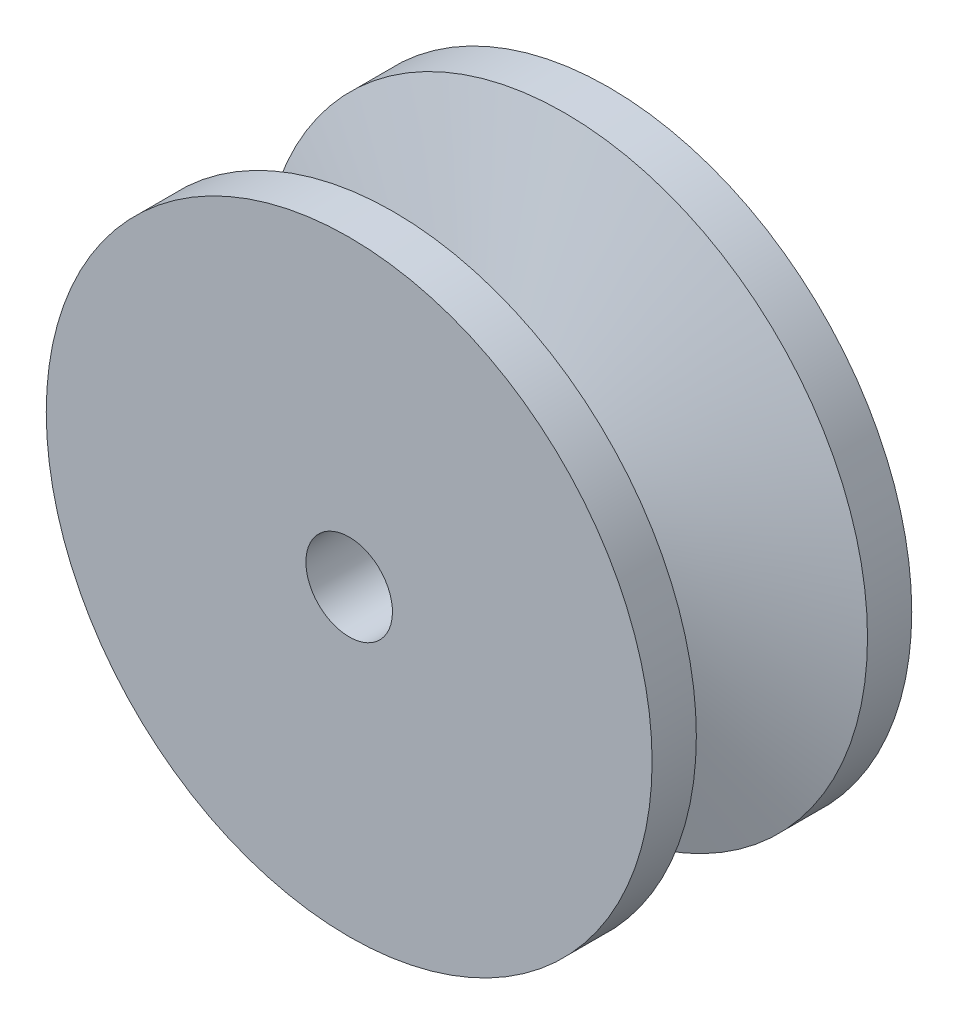
ISO-10303-21;
HEADER;
FILE_DESCRIPTION(('STEP AP214'),'2;1');
FILE_NAME('part.step','',(''),(''),'','','');
FILE_SCHEMA(('AUTOMOTIVE_DESIGN { 1 0 10303 214 1 1 1 1 }'));
ENDSEC;
DATA;
#1=APPLICATION_CONTEXT('core data for automotive mechanical design processes');
#2=APPLICATION_PROTOCOL_DEFINITION('international standard','automotive_design',2000,#1);
#3=PRODUCT_CONTEXT('',#1,'mechanical');
#4=PRODUCT('Part','Part','',(#3));
#5=PRODUCT_RELATED_PRODUCT_CATEGORY('part','',(#4));
#6=PRODUCT_DEFINITION_FORMATION('','',#4);
#7=PRODUCT_DEFINITION_CONTEXT('part definition',#1,'design');
#8=PRODUCT_DEFINITION('design','',#6,#7);
#9=PRODUCT_DEFINITION_SHAPE('','',#8);
#10=(LENGTH_UNIT() NAMED_UNIT(*) SI_UNIT(.MILLI.,.METRE.));
#11=(NAMED_UNIT(*) PLANE_ANGLE_UNIT() SI_UNIT($,.RADIAN.));
#12=(NAMED_UNIT(*) SI_UNIT($,.STERADIAN.) SOLID_ANGLE_UNIT());
#13=UNCERTAINTY_MEASURE_WITH_UNIT(LENGTH_MEASURE(1.E-05),#10,'distance_accuracy_value','');
#14=(GEOMETRIC_REPRESENTATION_CONTEXT(3) GLOBAL_UNCERTAINTY_ASSIGNED_CONTEXT((#13)) GLOBAL_UNIT_ASSIGNED_CONTEXT((#10,
#11,#12)) REPRESENTATION_CONTEXT('',''));
#15=CARTESIAN_POINT('',(0.,0.,0.));
#16=DIRECTION('',(0.,0.,1.));
#17=DIRECTION('',(1.,0.,0.));
#18=AXIS2_PLACEMENT_3D('',#15,#16,#17);
#19=CARTESIAN_POINT('',(0.,0.,9.525));
#20=DIRECTION('',(0.,0.,-1.));
#21=DIRECTION('',(-1.,0.,0.));
#22=AXIS2_PLACEMENT_3D('',#19,#20,#21);
#23=PLANE('',#22);
#24=CARTESIAN_POINT('',(0.,0.,9.525));
#25=DIRECTION('',(0.,0.,-1.));
#26=DIRECTION('',(0.,1.,0.));
#27=AXIS2_PLACEMENT_3D('',#24,#25,#26);
#28=CIRCLE('',#27,3.175);
#29=CARTESIAN_POINT('',(0.,3.175,9.525));
#30=VERTEX_POINT('',#29);
#31=EDGE_CURVE('E67',#30,#30,#28,.T.);
#32=ORIENTED_EDGE('',*,*,#31,.T.);
#33=EDGE_LOOP('',(#32));
#34=FACE_BOUND('',#33,.T.);
#35=CARTESIAN_POINT('',(0.,0.,9.525));
#36=DIRECTION('',(0.,0.,1.));
#37=DIRECTION('',(1.,0.,0.));
#38=AXIS2_PLACEMENT_3D('',#35,#36,#37);
#39=CIRCLE('',#38,22.225);
#40=CARTESIAN_POINT('',(22.225,0.,9.525));
#41=VERTEX_POINT('',#40);
#42=EDGE_CURVE('E12',#41,#41,#39,.T.);
#43=ORIENTED_EDGE('',*,*,#42,.T.);
#44=EDGE_LOOP('',(#43));
#45=FACE_BOUND('',#44,.T.);
#46=ADVANCED_FACE('F42',(#34,#45),#23,.F.);
#47=CARTESIAN_POINT('',(0.,0.,9.525));
#48=DIRECTION('',(0.,0.,1.));
#49=DIRECTION('',(1.,0.,0.));
#50=AXIS2_PLACEMENT_3D('',#47,#48,#49);
#51=CYLINDRICAL_SURFACE('',#50,22.225);
#52=ORIENTED_EDGE('',*,*,#42,.F.);
#53=EDGE_LOOP('',(#52));
#54=FACE_BOUND('',#53,.T.);
#55=CARTESIAN_POINT('',(0.,0.,6.27929491363124));
#56=DIRECTION('',(0.,0.,1.));
#57=DIRECTION('',(1.,0.,0.));
#58=AXIS2_PLACEMENT_3D('',#55,#56,#57);
#59=CIRCLE('',#58,22.225);
#60=CARTESIAN_POINT('',(22.225,0.,6.27929491363124));
#61=VERTEX_POINT('',#60);
#62=EDGE_CURVE('E48',#61,#61,#59,.T.);
#63=ORIENTED_EDGE('',*,*,#62,.T.);
#64=EDGE_LOOP('',(#63));
#65=FACE_BOUND('',#64,.T.);
#66=ADVANCED_FACE('F100',(#54,#65),#51,.T.);
#67=CARTESIAN_POINT('',(0.,0.,2.47417085219678));
#68=DIRECTION('',(0.,0.,1.));
#69=DIRECTION('',(1.,0.,0.));
#70=AXIS2_PLACEMENT_3D('',#67,#68,#69);
#71=CONICAL_SURFACE('',#70,9.779,1.27409035395586);
#72=ORIENTED_EDGE('',*,*,#62,.F.);
#73=EDGE_LOOP('',(#72));
#74=FACE_BOUND('',#73,.T.);
#75=CARTESIAN_POINT('',(0.,0.,2.47417085219678));
#76=DIRECTION('',(0.,0.,1.));
#77=DIRECTION('',(1.,0.,0.));
#78=AXIS2_PLACEMENT_3D('',#75,#76,#77);
#79=CIRCLE('',#78,9.779);
#80=CARTESIAN_POINT('',(9.779,0.,2.47417085219678));
#81=VERTEX_POINT('',#80);
#82=EDGE_CURVE('E52',#81,#81,#79,.T.);
#83=ORIENTED_EDGE('',*,*,#82,.T.);
#84=EDGE_LOOP('',(#83));
#85=FACE_BOUND('',#84,.T.);
#86=ADVANCED_FACE('F104',(#74,#85),#71,.T.);
#87=CARTESIAN_POINT('',(0.,0.,9.525));
#88=DIRECTION('',(0.,0.,1.));
#89=DIRECTION('',(1.,0.,0.));
#90=AXIS2_PLACEMENT_3D('',#87,#88,#89);
#91=CYLINDRICAL_SURFACE('',#90,9.779);
#92=ORIENTED_EDGE('',*,*,#82,.F.);
#93=EDGE_LOOP('',(#92));
#94=FACE_BOUND('',#93,.T.);
#95=CARTESIAN_POINT('',(0.,0.,-2.47417085219678));
#96=DIRECTION('',(0.,0.,1.));
#97=DIRECTION('',(1.,0.,0.));
#98=AXIS2_PLACEMENT_3D('',#95,#96,#97);
#99=CIRCLE('',#98,9.779);
#100=CARTESIAN_POINT('',(9.779,0.,-2.47417085219678));
#101=VERTEX_POINT('',#100);
#102=EDGE_CURVE('E56',#101,#101,#99,.T.);
#103=ORIENTED_EDGE('',*,*,#102,.T.);
#104=EDGE_LOOP('',(#103));
#105=FACE_BOUND('',#104,.T.);
#106=ADVANCED_FACE('F95',(#94,#105),#91,.T.);
#107=CARTESIAN_POINT('',(0.,0.,-6.27929491363124));
#108=DIRECTION('',(0.,0.,-1.));
#109=DIRECTION('',(-1.,0.,0.));
#110=AXIS2_PLACEMENT_3D('',#107,#108,#109);
#111=CONICAL_SURFACE('',#110,22.225,1.27409035395586);
#112=ORIENTED_EDGE('',*,*,#102,.F.);
#113=EDGE_LOOP('',(#112));
#114=FACE_BOUND('',#113,.T.);
#115=CARTESIAN_POINT('',(0.,0.,-6.27929491363124));
#116=DIRECTION('',(0.,0.,1.));
#117=DIRECTION('',(1.,0.,0.));
#118=AXIS2_PLACEMENT_3D('',#115,#116,#117);
#119=CIRCLE('',#118,22.225);
#120=CARTESIAN_POINT('',(22.225,0.,-6.27929491363124));
#121=VERTEX_POINT('',#120);
#122=EDGE_CURVE('E61',#121,#121,#119,.T.);
#123=ORIENTED_EDGE('',*,*,#122,.T.);
#124=EDGE_LOOP('',(#123));
#125=FACE_BOUND('',#124,.T.);
#126=ADVANCED_FACE('F89',(#114,#125),#111,.T.);
#127=CARTESIAN_POINT('',(0.,0.,9.525));
#128=DIRECTION('',(0.,0.,1.));
#129=DIRECTION('',(1.,0.,0.));
#130=AXIS2_PLACEMENT_3D('',#127,#128,#129);
#131=CYLINDRICAL_SURFACE('',#130,22.225);
#132=ORIENTED_EDGE('',*,*,#122,.F.);
#133=EDGE_LOOP('',(#132));
#134=FACE_BOUND('',#133,.T.);
#135=CARTESIAN_POINT('',(0.,0.,-9.525));
#136=DIRECTION('',(0.,0.,1.));
#137=DIRECTION('',(1.,0.,0.));
#138=AXIS2_PLACEMENT_3D('',#135,#136,#137);
#139=CIRCLE('',#138,22.225);
#140=CARTESIAN_POINT('',(22.225,0.,-9.525));
#141=VERTEX_POINT('',#140);
#142=EDGE_CURVE('E64',#141,#141,#139,.T.);
#143=ORIENTED_EDGE('',*,*,#142,.T.);
#144=EDGE_LOOP('',(#143));
#145=FACE_BOUND('',#144,.T.);
#146=ADVANCED_FACE('F84',(#134,#145),#131,.T.);
#147=CARTESIAN_POINT('',(0.,22.225,-9.525));
#148=DIRECTION('',(0.,0.,1.));
#149=DIRECTION('',(1.,0.,0.));
#150=AXIS2_PLACEMENT_3D('',#147,#148,#149);
#151=PLANE('',#150);
#152=CARTESIAN_POINT('',(0.,0.,-9.525));
#153=DIRECTION('',(0.,0.,-1.));
#154=DIRECTION('',(0.,1.,0.));
#155=AXIS2_PLACEMENT_3D('',#152,#153,#154);
#156=CIRCLE('',#155,3.175);
#157=CARTESIAN_POINT('',(0.,3.175,-9.525));
#158=VERTEX_POINT('',#157);
#159=EDGE_CURVE('E68',#158,#158,#156,.T.);
#160=ORIENTED_EDGE('',*,*,#159,.F.);
#161=EDGE_LOOP('',(#160));
#162=FACE_BOUND('',#161,.T.);
#163=ORIENTED_EDGE('',*,*,#142,.F.);
#164=EDGE_LOOP('',(#163));
#165=FACE_BOUND('',#164,.T.);
#166=ADVANCED_FACE('F78',(#162,#165),#151,.F.);
#167=CARTESIAN_POINT('',(0.,0.,9.525));
#168=DIRECTION('',(0.,0.,-1.));
#169=DIRECTION('',(0.,1.,0.));
#170=AXIS2_PLACEMENT_3D('',#167,#168,#169);
#171=CYLINDRICAL_SURFACE('',#170,3.175);
#172=ORIENTED_EDGE('',*,*,#31,.F.);
#173=EDGE_LOOP('',(#172));
#174=FACE_BOUND('',#173,.T.);
#175=ORIENTED_EDGE('',*,*,#159,.T.);
#176=EDGE_LOOP('',(#175));
#177=FACE_BOUND('',#176,.T.);
#178=ADVANCED_FACE('F75',(#174,#177),#171,.F.);
#179=CLOSED_SHELL('',(#46,#66,#86,#106,#126,#146,#166,#178));
#180=MANIFOLD_SOLID_BREP('B2',#179);
#181=ADVANCED_BREP_SHAPE_REPRESENTATION('',(#18,#180),#14);
#182=SHAPE_DEFINITION_REPRESENTATION(#9,#181);
ENDSEC;
END-ISO-10303-21;
